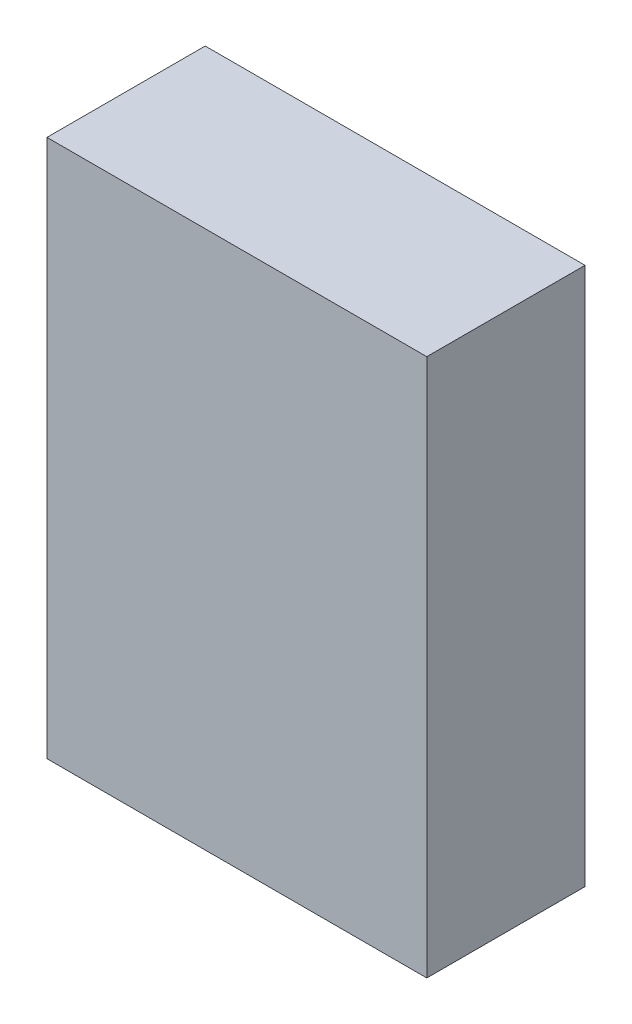
ISO-10303-21;
HEADER;
FILE_DESCRIPTION(('STEP AP214'),'2;1');
FILE_NAME('part.step','',(''),(''),'','','');
FILE_SCHEMA(('AUTOMOTIVE_DESIGN { 1 0 10303 214 1 1 1 1 }'));
ENDSEC;
DATA;
#1=APPLICATION_CONTEXT('core data for automotive mechanical design processes');
#2=APPLICATION_PROTOCOL_DEFINITION('international standard','automotive_design',2000,#1);
#3=PRODUCT_CONTEXT('',#1,'mechanical');
#4=PRODUCT('Part','Part','',(#3));
#5=PRODUCT_RELATED_PRODUCT_CATEGORY('part','',(#4));
#6=PRODUCT_DEFINITION_FORMATION('','',#4);
#7=PRODUCT_DEFINITION_CONTEXT('part definition',#1,'design');
#8=PRODUCT_DEFINITION('design','',#6,#7);
#9=PRODUCT_DEFINITION_SHAPE('','',#8);
#10=(LENGTH_UNIT() NAMED_UNIT(*) SI_UNIT(.MILLI.,.METRE.));
#11=(NAMED_UNIT(*) PLANE_ANGLE_UNIT() SI_UNIT($,.RADIAN.));
#12=(NAMED_UNIT(*) SI_UNIT($,.STERADIAN.) SOLID_ANGLE_UNIT());
#13=UNCERTAINTY_MEASURE_WITH_UNIT(LENGTH_MEASURE(1.E-05),#10,'distance_accuracy_value','');
#14=(GEOMETRIC_REPRESENTATION_CONTEXT(3) GLOBAL_UNCERTAINTY_ASSIGNED_CONTEXT((#13)) GLOBAL_UNIT_ASSIGNED_CONTEXT((#10,
#11,#12)) REPRESENTATION_CONTEXT('',''));
#15=CARTESIAN_POINT('',(0.,0.,0.));
#16=DIRECTION('',(0.,0.,1.));
#17=DIRECTION('',(1.,0.,0.));
#18=AXIS2_PLACEMENT_3D('',#15,#16,#17);
#19=CARTESIAN_POINT('',(1.13,2.58,0.));
#20=DIRECTION('',(1.,0.,0.));
#21=DIRECTION('',(0.,0.,1.));
#22=AXIS2_PLACEMENT_3D('',#19,#20,#21);
#23=PLANE('',#22);
#24=DIRECTION('',(0.,1.,0.));
#25=VECTOR('',#24,1.);
#26=CARTESIAN_POINT('',(1.13,2.58,0.1));
#27=LINE('',#26,#25);
#28=CARTESIAN_POINT('',(1.13,2.58,0.1));
#29=VERTEX_POINT('',#28);
#30=CARTESIAN_POINT('',(1.13,2.92,0.1));
#31=VERTEX_POINT('',#30);
#32=EDGE_CURVE('E11',#29,#31,#27,.T.);
#33=ORIENTED_EDGE('',*,*,#32,.T.);
#34=DIRECTION('',(0.,0.,1.));
#35=VECTOR('',#34,1.);
#36=CARTESIAN_POINT('',(1.13,2.92,0.));
#37=LINE('',#36,#35);
#38=CARTESIAN_POINT('',(1.13,2.92,0.));
#39=VERTEX_POINT('',#38);
#40=EDGE_CURVE('E24',#39,#31,#37,.T.);
#41=ORIENTED_EDGE('',*,*,#40,.F.);
#42=DIRECTION('',(0.,1.,0.));
#43=VECTOR('',#42,1.);
#44=CARTESIAN_POINT('',(1.13,2.58,0.));
#45=LINE('',#44,#43);
#46=CARTESIAN_POINT('',(1.13,2.58,0.));
#47=VERTEX_POINT('',#46);
#48=EDGE_CURVE('E86',#47,#39,#45,.T.);
#49=ORIENTED_EDGE('',*,*,#48,.F.);
#50=DIRECTION('',(0.,0.,1.));
#51=VECTOR('',#50,1.);
#52=CARTESIAN_POINT('',(1.13,2.58,0.));
#53=LINE('',#52,#51);
#54=EDGE_CURVE('E36',#47,#29,#53,.T.);
#55=ORIENTED_EDGE('',*,*,#54,.T.);
#56=EDGE_LOOP('',(#33,#41,#49,#55));
#57=FACE_BOUND('',#56,.T.);
#58=ADVANCED_FACE('F17',(#57),#23,.F.);
#59=CARTESIAN_POINT('',(1.37,2.58,0.));
#60=DIRECTION('',(1.,0.,0.));
#61=DIRECTION('',(0.,0.,1.));
#62=AXIS2_PLACEMENT_3D('',#59,#60,#61);
#63=PLANE('',#62);
#64=DIRECTION('',(0.,0.,1.));
#65=VECTOR('',#64,1.);
#66=CARTESIAN_POINT('',(1.37,2.58,0.));
#67=LINE('',#66,#65);
#68=CARTESIAN_POINT('',(1.37,2.58,0.));
#69=VERTEX_POINT('',#68);
#70=CARTESIAN_POINT('',(1.37,2.58,0.1));
#71=VERTEX_POINT('',#70);
#72=EDGE_CURVE('E83',#69,#71,#67,.T.);
#73=ORIENTED_EDGE('',*,*,#72,.F.);
#74=DIRECTION('',(0.,1.,0.));
#75=VECTOR('',#74,1.);
#76=CARTESIAN_POINT('',(1.37,2.58,0.));
#77=LINE('',#76,#75);
#78=CARTESIAN_POINT('',(1.37,2.92,0.));
#79=VERTEX_POINT('',#78);
#80=EDGE_CURVE('E63',#69,#79,#77,.T.);
#81=ORIENTED_EDGE('',*,*,#80,.T.);
#82=DIRECTION('',(0.,0.,1.));
#83=VECTOR('',#82,1.);
#84=CARTESIAN_POINT('',(1.37,2.92,0.));
#85=LINE('',#84,#83);
#86=CARTESIAN_POINT('',(1.37,2.92,0.1));
#87=VERTEX_POINT('',#86);
#88=EDGE_CURVE('E57',#79,#87,#85,.T.);
#89=ORIENTED_EDGE('',*,*,#88,.T.);
#90=DIRECTION('',(0.,1.,0.));
#91=VECTOR('',#90,1.);
#92=CARTESIAN_POINT('',(1.37,2.58,0.1));
#93=LINE('',#92,#91);
#94=EDGE_CURVE('E60',#71,#87,#93,.T.);
#95=ORIENTED_EDGE('',*,*,#94,.F.);
#96=EDGE_LOOP('',(#73,#81,#89,#95));
#97=FACE_BOUND('',#96,.T.);
#98=ADVANCED_FACE('F59',(#97),#63,.T.);
#99=CARTESIAN_POINT('',(1.13,2.58,0.));
#100=DIRECTION('',(0.,1.,0.));
#101=DIRECTION('',(0.,0.,1.));
#102=AXIS2_PLACEMENT_3D('',#99,#100,#101);
#103=PLANE('',#102);
#104=ORIENTED_EDGE('',*,*,#72,.T.);
#105=DIRECTION('',(1.,0.,0.));
#106=VECTOR('',#105,1.);
#107=CARTESIAN_POINT('',(1.13,2.58,0.1));
#108=LINE('',#107,#106);
#109=EDGE_CURVE('E71',#29,#71,#108,.T.);
#110=ORIENTED_EDGE('',*,*,#109,.F.);
#111=ORIENTED_EDGE('',*,*,#54,.F.);
#112=DIRECTION('',(1.,0.,0.));
#113=VECTOR('',#112,1.);
#114=CARTESIAN_POINT('',(1.13,2.58,0.));
#115=LINE('',#114,#113);
#116=EDGE_CURVE('E76',#47,#69,#115,.T.);
#117=ORIENTED_EDGE('',*,*,#116,.T.);
#118=EDGE_LOOP('',(#104,#110,#111,#117));
#119=FACE_BOUND('',#118,.T.);
#120=ADVANCED_FACE('F91',(#119),#103,.F.);
#121=CARTESIAN_POINT('',(1.13,2.92,0.));
#122=DIRECTION('',(0.,1.,0.));
#123=DIRECTION('',(0.,0.,1.));
#124=AXIS2_PLACEMENT_3D('',#121,#122,#123);
#125=PLANE('',#124);
#126=DIRECTION('',(1.,0.,0.));
#127=VECTOR('',#126,1.);
#128=CARTESIAN_POINT('',(1.13,2.92,0.));
#129=LINE('',#128,#127);
#130=EDGE_CURVE('E74',#39,#79,#129,.T.);
#131=ORIENTED_EDGE('',*,*,#130,.F.);
#132=ORIENTED_EDGE('',*,*,#40,.T.);
#133=DIRECTION('',(1.,0.,0.));
#134=VECTOR('',#133,1.);
#135=CARTESIAN_POINT('',(1.13,2.92,0.1));
#136=LINE('',#135,#134);
#137=EDGE_CURVE('E69',#31,#87,#136,.T.);
#138=ORIENTED_EDGE('',*,*,#137,.T.);
#139=ORIENTED_EDGE('',*,*,#88,.F.);
#140=EDGE_LOOP('',(#131,#132,#138,#139));
#141=FACE_BOUND('',#140,.T.);
#142=ADVANCED_FACE('F73',(#141),#125,.T.);
#143=CARTESIAN_POINT('',(1.13,2.58,0.));
#144=DIRECTION('',(0.,0.,1.));
#145=DIRECTION('',(1.,0.,0.));
#146=AXIS2_PLACEMENT_3D('',#143,#144,#145);
#147=PLANE('',#146);
#148=ORIENTED_EDGE('',*,*,#130,.T.);
#149=ORIENTED_EDGE('',*,*,#80,.F.);
#150=ORIENTED_EDGE('',*,*,#116,.F.);
#151=ORIENTED_EDGE('',*,*,#48,.T.);
#152=EDGE_LOOP('',(#148,#149,#150,#151));
#153=FACE_BOUND('',#152,.T.);
#154=ADVANCED_FACE('F89',(#153),#147,.F.);
#155=CARTESIAN_POINT('',(1.13,2.58,0.1));
#156=DIRECTION('',(0.,0.,1.));
#157=DIRECTION('',(1.,0.,0.));
#158=AXIS2_PLACEMENT_3D('',#155,#156,#157);
#159=PLANE('',#158);
#160=ORIENTED_EDGE('',*,*,#32,.F.);
#161=ORIENTED_EDGE('',*,*,#109,.T.);
#162=ORIENTED_EDGE('',*,*,#94,.T.);
#163=ORIENTED_EDGE('',*,*,#137,.F.);
#164=EDGE_LOOP('',(#160,#161,#162,#163));
#165=FACE_BOUND('',#164,.T.);
#166=ADVANCED_FACE('F68',(#165),#159,.T.);
#167=CLOSED_SHELL('',(#58,#98,#120,#142,#154,#166));
#168=MANIFOLD_SOLID_BREP('B1',#167);
#169=ADVANCED_BREP_SHAPE_REPRESENTATION('',(#18,#168),#14);
#170=SHAPE_DEFINITION_REPRESENTATION(#9,#169);
ENDSEC;
END-ISO-10303-21;
